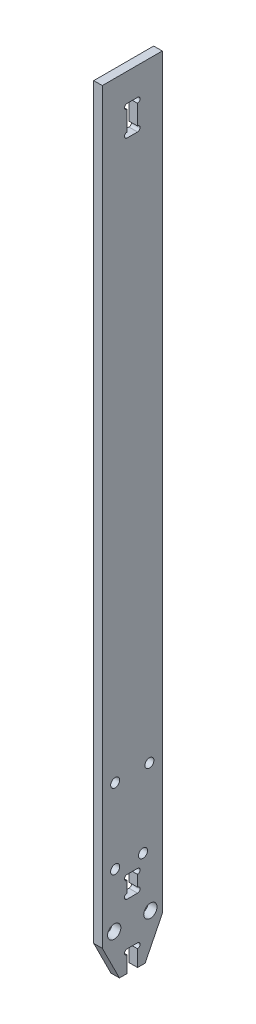
ISO-10303-21;
HEADER;
FILE_DESCRIPTION(('STEP AP214'),'2;1');
FILE_NAME('part.step','',(''),(''),'','','');
FILE_SCHEMA(('AUTOMOTIVE_DESIGN { 1 0 10303 214 1 1 1 1 }'));
ENDSEC;
DATA;
#1=APPLICATION_CONTEXT('core data for automotive mechanical design processes');
#2=APPLICATION_PROTOCOL_DEFINITION('international standard','automotive_design',2000,#1);
#3=PRODUCT_CONTEXT('',#1,'mechanical');
#4=PRODUCT('Part','Part','',(#3));
#5=PRODUCT_RELATED_PRODUCT_CATEGORY('part','',(#4));
#6=PRODUCT_DEFINITION_FORMATION('','',#4);
#7=PRODUCT_DEFINITION_CONTEXT('part definition',#1,'design');
#8=PRODUCT_DEFINITION('design','',#6,#7);
#9=PRODUCT_DEFINITION_SHAPE('','',#8);
#10=(LENGTH_UNIT() NAMED_UNIT(*) SI_UNIT(.MILLI.,.METRE.));
#11=(NAMED_UNIT(*) PLANE_ANGLE_UNIT() SI_UNIT($,.RADIAN.));
#12=(NAMED_UNIT(*) SI_UNIT($,.STERADIAN.) SOLID_ANGLE_UNIT());
#13=UNCERTAINTY_MEASURE_WITH_UNIT(LENGTH_MEASURE(1.E-05),#10,'distance_accuracy_value','');
#14=(GEOMETRIC_REPRESENTATION_CONTEXT(3) GLOBAL_UNCERTAINTY_ASSIGNED_CONTEXT((#13)) GLOBAL_UNIT_ASSIGNED_CONTEXT((#10,
#11,#12)) REPRESENTATION_CONTEXT('',''));
#15=CARTESIAN_POINT('',(0.,0.,0.));
#16=DIRECTION('',(0.,0.,1.));
#17=DIRECTION('',(1.,0.,0.));
#18=AXIS2_PLACEMENT_3D('',#15,#16,#17);
#19=CARTESIAN_POINT('',(1.,-91.25,-7.));
#20=DIRECTION('',(0.,1.,0.));
#21=DIRECTION('',(0.,0.,1.));
#22=AXIS2_PLACEMENT_3D('',#19,#20,#21);
#23=PLANE('',#22);
#24=DIRECTION('',(0.,0.,-1.));
#25=VECTOR('',#24,1.);
#26=CARTESIAN_POINT('',(1.,-91.25,-7.));
#27=LINE('',#26,#25);
#28=CARTESIAN_POINT('',(1.,-91.25,3.));
#29=VERTEX_POINT('',#28);
#30=CARTESIAN_POINT('',(1.,-91.25,1.22499999999995));
#31=VERTEX_POINT('',#30);
#32=EDGE_CURVE('E231',#29,#31,#27,.T.);
#33=ORIENTED_EDGE('',*,*,#32,.F.);
#34=DIRECTION('',(1.,0.,0.));
#35=VECTOR('',#34,1.);
#36=CARTESIAN_POINT('',(-1.,-91.25,3.));
#37=LINE('',#36,#35);
#38=CARTESIAN_POINT('',(-1.,-91.25,3.));
#39=VERTEX_POINT('',#38);
#40=EDGE_CURVE('E218',#39,#29,#37,.T.);
#41=ORIENTED_EDGE('',*,*,#40,.F.);
#42=DIRECTION('',(0.,0.,-1.));
#43=VECTOR('',#42,1.);
#44=CARTESIAN_POINT('',(-1.,-91.25,-7.));
#45=LINE('',#44,#43);
#46=CARTESIAN_POINT('',(-1.,-91.25,1.22499999999995));
#47=VERTEX_POINT('',#46);
#48=EDGE_CURVE('E229',#39,#47,#45,.T.);
#49=ORIENTED_EDGE('',*,*,#48,.T.);
#50=DIRECTION('',(1.,0.,0.));
#51=VECTOR('',#50,1.);
#52=CARTESIAN_POINT('',(-1.,-91.25,1.22499999999995));
#53=LINE('',#52,#51);
#54=EDGE_CURVE('E334',#47,#31,#53,.T.);
#55=ORIENTED_EDGE('',*,*,#54,.T.);
#56=EDGE_LOOP('',(#33,#41,#49,#55));
#57=FACE_BOUND('',#56,.T.);
#58=ADVANCED_FACE('F33',(#57),#23,.F.);
#59=CARTESIAN_POINT('',(1.,-91.25,7.));
#60=DIRECTION('',(0.,0.,-1.));
#61=DIRECTION('',(-1.,0.,0.));
#62=AXIS2_PLACEMENT_3D('',#59,#60,#61);
#63=PLANE('',#62);
#64=DIRECTION('',(0.,-1.,0.));
#65=VECTOR('',#64,1.);
#66=CARTESIAN_POINT('',(-1.,-91.25,7.));
#67=LINE('',#66,#65);
#68=CARTESIAN_POINT('',(-1.,91.25,7.));
#69=VERTEX_POINT('',#68);
#70=CARTESIAN_POINT('',(-1.,-83.2500000000001,6.99999999999998));
#71=VERTEX_POINT('',#70);
#72=EDGE_CURVE('E244',#69,#71,#67,.T.);
#73=ORIENTED_EDGE('',*,*,#72,.T.);
#74=DIRECTION('',(1.,0.,0.));
#75=VECTOR('',#74,1.);
#76=CARTESIAN_POINT('',(-1.,-83.25,7.));
#77=LINE('',#76,#75);
#78=CARTESIAN_POINT('',(1.,-83.25,7.));
#79=VERTEX_POINT('',#78);
#80=EDGE_CURVE('E56',#71,#79,#77,.T.);
#81=ORIENTED_EDGE('',*,*,#80,.T.);
#82=DIRECTION('',(0.,-1.,0.));
#83=VECTOR('',#82,1.);
#84=CARTESIAN_POINT('',(1.,-91.25,7.));
#85=LINE('',#84,#83);
#86=CARTESIAN_POINT('',(1.,91.25,7.));
#87=VERTEX_POINT('',#86);
#88=EDGE_CURVE('E249',#87,#79,#85,.T.);
#89=ORIENTED_EDGE('',*,*,#88,.F.);
#90=DIRECTION('',(-1.,0.,0.));
#91=VECTOR('',#90,1.);
#92=CARTESIAN_POINT('',(1.,91.25,7.));
#93=LINE('',#92,#91);
#94=EDGE_CURVE('E250',#87,#69,#93,.T.);
#95=ORIENTED_EDGE('',*,*,#94,.T.);
#96=EDGE_LOOP('',(#73,#81,#89,#95));
#97=FACE_BOUND('',#96,.T.);
#98=ADVANCED_FACE('F35',(#97),#63,.F.);
#99=CARTESIAN_POINT('',(-1.,-91.25,-1.22499999999995));
#100=VERTEX_POINT('',#99);
#101=CARTESIAN_POINT('',(-1.,-91.25,-3.));
#102=VERTEX_POINT('',#101);
#103=EDGE_CURVE('E239',#100,#102,#45,.T.);
#104=ORIENTED_EDGE('',*,*,#103,.T.);
#105=DIRECTION('',(1.,0.,0.));
#106=VECTOR('',#105,1.);
#107=CARTESIAN_POINT('',(-1.,-91.2499999999999,-3.));
#108=LINE('',#107,#106);
#109=CARTESIAN_POINT('',(1.,-91.2499999999999,-3.));
#110=VERTEX_POINT('',#109);
#111=EDGE_CURVE('E48',#102,#110,#108,.T.);
#112=ORIENTED_EDGE('',*,*,#111,.T.);
#113=CARTESIAN_POINT('',(1.,-91.25,-1.22499999999995));
#114=VERTEX_POINT('',#113);
#115=EDGE_CURVE('E352',#114,#110,#27,.T.);
#116=ORIENTED_EDGE('',*,*,#115,.F.);
#117=DIRECTION('',(1.,0.,0.));
#118=VECTOR('',#117,1.);
#119=CARTESIAN_POINT('',(-1.,-91.25,-1.22499999999995));
#120=LINE('',#119,#118);
#121=EDGE_CURVE('E347',#100,#114,#120,.T.);
#122=ORIENTED_EDGE('',*,*,#121,.F.);
#123=EDGE_LOOP('',(#104,#112,#116,#122));
#124=FACE_BOUND('',#123,.T.);
#125=ADVANCED_FACE('F507',(#124),#23,.F.);
#126=CARTESIAN_POINT('',(1.,-91.25,-7.));
#127=DIRECTION('',(0.,0.,1.));
#128=DIRECTION('',(1.,0.,0.));
#129=AXIS2_PLACEMENT_3D('',#126,#127,#128);
#130=PLANE('',#129);
#131=DIRECTION('',(0.,1.,0.));
#132=VECTOR('',#131,1.);
#133=CARTESIAN_POINT('',(1.,-91.25,-7.));
#134=LINE('',#133,#132);
#135=CARTESIAN_POINT('',(1.,-83.2499999999999,-6.99999999999984));
#136=VERTEX_POINT('',#135);
#137=CARTESIAN_POINT('',(1.,91.25,-7.));
#138=VERTEX_POINT('',#137);
#139=EDGE_CURVE('E354',#136,#138,#134,.T.);
#140=ORIENTED_EDGE('',*,*,#139,.F.);
#141=DIRECTION('',(1.,0.,0.));
#142=VECTOR('',#141,1.);
#143=CARTESIAN_POINT('',(-1.,-83.2499999999999,-6.99999999999984));
#144=LINE('',#143,#142);
#145=CARTESIAN_POINT('',(-1.,-83.2499999999999,-6.99999999999984));
#146=VERTEX_POINT('',#145);
#147=EDGE_CURVE('E379',#146,#136,#144,.T.);
#148=ORIENTED_EDGE('',*,*,#147,.F.);
#149=DIRECTION('',(0.,1.,0.));
#150=VECTOR('',#149,1.);
#151=CARTESIAN_POINT('',(-1.,-91.25,-7.));
#152=LINE('',#151,#150);
#153=CARTESIAN_POINT('',(-1.,91.25,-7.));
#154=VERTEX_POINT('',#153);
#155=EDGE_CURVE('E238',#146,#154,#152,.T.);
#156=ORIENTED_EDGE('',*,*,#155,.T.);
#157=DIRECTION('',(-1.,0.,0.));
#158=VECTOR('',#157,1.);
#159=CARTESIAN_POINT('',(1.,91.25,-7.));
#160=LINE('',#159,#158);
#161=EDGE_CURVE('E253',#138,#154,#160,.T.);
#162=ORIENTED_EDGE('',*,*,#161,.F.);
#163=EDGE_LOOP('',(#140,#148,#156,#162));
#164=FACE_BOUND('',#163,.T.);
#165=ADVANCED_FACE('F513',(#164),#130,.F.);
#166=CARTESIAN_POINT('',(1.,91.25,-7.));
#167=DIRECTION('',(0.,-1.,0.));
#168=DIRECTION('',(0.,0.,-1.));
#169=AXIS2_PLACEMENT_3D('',#166,#167,#168);
#170=PLANE('',#169);
#171=DIRECTION('',(0.,0.,1.));
#172=VECTOR('',#171,1.);
#173=CARTESIAN_POINT('',(-1.,91.25,-7.));
#174=LINE('',#173,#172);
#175=EDGE_CURVE('E241',#154,#69,#174,.T.);
#176=ORIENTED_EDGE('',*,*,#175,.T.);
#177=ORIENTED_EDGE('',*,*,#94,.F.);
#178=DIRECTION('',(0.,0.,1.));
#179=VECTOR('',#178,1.);
#180=CARTESIAN_POINT('',(1.,91.25,-7.));
#181=LINE('',#180,#179);
#182=EDGE_CURVE('E254',#138,#87,#181,.T.);
#183=ORIENTED_EDGE('',*,*,#182,.F.);
#184=ORIENTED_EDGE('',*,*,#161,.T.);
#185=EDGE_LOOP('',(#176,#177,#183,#184));
#186=FACE_BOUND('',#185,.T.);
#187=ADVANCED_FACE('F365',(#186),#170,.F.);
#188=CARTESIAN_POINT('',(1.,0.,0.));
#189=DIRECTION('',(1.,0.,0.));
#190=DIRECTION('',(0.,0.,-1.));
#191=AXIS2_PLACEMENT_3D('',#188,#189,#190);
#192=PLANE('',#191);
#193=CARTESIAN_POINT('',(1.,-51.25,-4.));
#194=DIRECTION('',(-1.,0.,0.));
#195=DIRECTION('',(0.,0.,1.));
#196=AXIS2_PLACEMENT_3D('',#193,#194,#195);
#197=CIRCLE('',#196,1.04999999999999);
#198=CARTESIAN_POINT('',(1.,-51.25,-2.95000000000001));
#199=VERTEX_POINT('',#198);
#200=EDGE_CURVE('E881',#199,#199,#197,.T.);
#201=ORIENTED_EDGE('',*,*,#200,.T.);
#202=EDGE_LOOP('',(#201));
#203=FACE_BOUND('',#202,.T.);
#204=CARTESIAN_POINT('',(1.,-51.25,4.));
#205=DIRECTION('',(-1.,0.,0.));
#206=DIRECTION('',(0.,0.,1.));
#207=AXIS2_PLACEMENT_3D('',#204,#205,#206);
#208=CIRCLE('',#207,1.04999999999999);
#209=CARTESIAN_POINT('',(1.,-51.25,5.04999999999999));
#210=VERTEX_POINT('',#209);
#211=EDGE_CURVE('E886',#210,#210,#208,.T.);
#212=ORIENTED_EDGE('',*,*,#211,.T.);
#213=EDGE_LOOP('',(#212));
#214=FACE_BOUND('',#213,.T.);
#215=CARTESIAN_POINT('',(1.,-68.75,-2.49999999999984));
#216=DIRECTION('',(-1.,0.,0.));
#217=DIRECTION('',(0.,0.,1.));
#218=AXIS2_PLACEMENT_3D('',#215,#216,#217);
#219=CIRCLE('',#218,1.04999999999999);
#220=CARTESIAN_POINT('',(1.,-68.75,-1.44999999999984));
#221=VERTEX_POINT('',#220);
#222=EDGE_CURVE('E873',#221,#221,#219,.T.);
#223=ORIENTED_EDGE('',*,*,#222,.T.);
#224=EDGE_LOOP('',(#223));
#225=FACE_BOUND('',#224,.T.);
#226=CARTESIAN_POINT('',(1.,-68.75,4.));
#227=DIRECTION('',(1.,0.,0.));
#228=DIRECTION('',(0.,0.,-1.));
#229=AXIS2_PLACEMENT_3D('',#226,#227,#228);
#230=CIRCLE('',#229,1.04999999999999);
#231=CARTESIAN_POINT('',(1.,-68.75,2.95000000000001));
#232=VERTEX_POINT('',#231);
#233=EDGE_CURVE('E871',#232,#232,#230,.T.);
#234=ORIENTED_EDGE('',*,*,#233,.F.);
#235=EDGE_LOOP('',(#234));
#236=FACE_BOUND('',#235,.T.);
#237=DIRECTION('',(0.,0.894427190999916,0.447213595499958));
#238=VECTOR('',#237,1.);
#239=CARTESIAN_POINT('',(1.,-91.25,3.));
#240=LINE('',#239,#238);
#241=EDGE_CURVE('E224',#29,#79,#240,.T.);
#242=ORIENTED_EDGE('',*,*,#241,.F.);
#243=ORIENTED_EDGE('',*,*,#32,.T.);
#244=DIRECTION('',(0.,-1.,0.));
#245=VECTOR('',#244,1.);
#246=CARTESIAN_POINT('',(1.,-91.25,1.22499999999995));
#247=LINE('',#246,#245);
#248=CARTESIAN_POINT('',(1.,-87.45,1.22500000000003));
#249=VERTEX_POINT('',#248);
#250=EDGE_CURVE('E325',#249,#31,#247,.T.);
#251=ORIENTED_EDGE('',*,*,#250,.F.);
#252=CARTESIAN_POINT('',(1.,-86.85,1.22500000000005));
#253=DIRECTION('',(1.,0.,0.));
#254=DIRECTION('',(0.,0.,-1.));
#255=AXIS2_PLACEMENT_3D('',#252,#253,#254);
#256=CIRCLE('',#255,0.600000000000003);
#257=CARTESIAN_POINT('',(1.,-86.25,1.22500000000005));
#258=VERTEX_POINT('',#257);
#259=EDGE_CURVE('E317',#258,#249,#256,.T.);
#260=ORIENTED_EDGE('',*,*,#259,.F.);
#261=DIRECTION('',(0.,0.,1.));
#262=VECTOR('',#261,1.);
#263=CARTESIAN_POINT('',(1.,-86.25,1.22500000000005));
#264=LINE('',#263,#262);
#265=CARTESIAN_POINT('',(1.,-86.25,-1.22499999999995));
#266=VERTEX_POINT('',#265);
#267=EDGE_CURVE('E328',#266,#258,#264,.T.);
#268=ORIENTED_EDGE('',*,*,#267,.F.);
#269=CARTESIAN_POINT('',(1.,-86.85,-1.22499999999995));
#270=DIRECTION('',(1.,0.,0.));
#271=DIRECTION('',(0.,0.,-1.));
#272=AXIS2_PLACEMENT_3D('',#269,#270,#271);
#273=CIRCLE('',#272,0.600000000000003);
#274=CARTESIAN_POINT('',(1.,-87.45,-1.22499999999995));
#275=VERTEX_POINT('',#274);
#276=EDGE_CURVE('E309',#275,#266,#273,.T.);
#277=ORIENTED_EDGE('',*,*,#276,.F.);
#278=DIRECTION('',(0.,1.,0.));
#279=VECTOR('',#278,1.);
#280=CARTESIAN_POINT('',(1.,-91.25,-1.22499999999995));
#281=LINE('',#280,#279);
#282=EDGE_CURVE('E337',#114,#275,#281,.T.);
#283=ORIENTED_EDGE('',*,*,#282,.F.);
#284=ORIENTED_EDGE('',*,*,#115,.T.);
#285=DIRECTION('',(0.,-0.894427190999925,0.44721359549994));
#286=VECTOR('',#285,1.);
#287=CARTESIAN_POINT('',(1.,-91.2499999999999,-3.));
#288=LINE('',#287,#286);
#289=EDGE_CURVE('E376',#136,#110,#288,.T.);
#290=ORIENTED_EDGE('',*,*,#289,.F.);
#291=ORIENTED_EDGE('',*,*,#139,.T.);
#292=ORIENTED_EDGE('',*,*,#182,.T.);
#293=ORIENTED_EDGE('',*,*,#88,.T.);
#294=EDGE_LOOP('',(#242,#243,#251,#260,#268,#277,#283,#284,#290,#291,#292,#293));
#295=FACE_BOUND('',#294,.T.);
#296=CARTESIAN_POINT('',(1.,78.35,1.225));
#297=DIRECTION('',(1.,0.,0.));
#298=DIRECTION('',(0.,0.,-1.));
#299=AXIS2_PLACEMENT_3D('',#296,#297,#298);
#300=CIRCLE('',#299,0.600000000000001);
#301=CARTESIAN_POINT('',(1.,78.95,1.225));
#302=VERTEX_POINT('',#301);
#303=CARTESIAN_POINT('',(1.,77.75,1.225));
#304=VERTEX_POINT('',#303);
#305=EDGE_CURVE('E389',#302,#304,#300,.T.);
#306=ORIENTED_EDGE('',*,*,#305,.F.);
#307=DIRECTION('',(0.,-1.,0.));
#308=VECTOR('',#307,1.);
#309=CARTESIAN_POINT('',(1.,77.75,1.225));
#310=LINE('',#309,#308);
#311=CARTESIAN_POINT('',(1.,83.55,1.225));
#312=VERTEX_POINT('',#311);
#313=EDGE_CURVE('E408',#312,#302,#310,.T.);
#314=ORIENTED_EDGE('',*,*,#313,.F.);
#315=CARTESIAN_POINT('',(1.,84.15,1.225));
#316=DIRECTION('',(1.,0.,0.));
#317=DIRECTION('',(0.,0.,-1.));
#318=AXIS2_PLACEMENT_3D('',#315,#316,#317);
#319=CIRCLE('',#318,0.600000000000001);
#320=CARTESIAN_POINT('',(1.,84.75,1.225));
#321=VERTEX_POINT('',#320);
#322=EDGE_CURVE('E388',#321,#312,#319,.T.);
#323=ORIENTED_EDGE('',*,*,#322,.F.);
#324=DIRECTION('',(0.,0.,1.));
#325=VECTOR('',#324,1.);
#326=CARTESIAN_POINT('',(1.,84.75,-1.225));
#327=LINE('',#326,#325);
#328=CARTESIAN_POINT('',(1.,84.75,-1.225));
#329=VERTEX_POINT('',#328);
#330=EDGE_CURVE('E413',#329,#321,#327,.T.);
#331=ORIENTED_EDGE('',*,*,#330,.F.);
#332=CARTESIAN_POINT('',(1.,84.15,-1.225));
#333=DIRECTION('',(1.,0.,0.));
#334=DIRECTION('',(0.,0.,-1.));
#335=AXIS2_PLACEMENT_3D('',#332,#333,#334);
#336=CIRCLE('',#335,0.600000000000001);
#337=CARTESIAN_POINT('',(1.,83.55,-1.225));
#338=VERTEX_POINT('',#337);
#339=EDGE_CURVE('E383',#338,#329,#336,.T.);
#340=ORIENTED_EDGE('',*,*,#339,.F.);
#341=DIRECTION('',(0.,1.,0.));
#342=VECTOR('',#341,1.);
#343=CARTESIAN_POINT('',(1.,77.75,-1.225));
#344=LINE('',#343,#342);
#345=CARTESIAN_POINT('',(1.,78.95,-1.225));
#346=VERTEX_POINT('',#345);
#347=EDGE_CURVE('E428',#346,#338,#344,.T.);
#348=ORIENTED_EDGE('',*,*,#347,.F.);
#349=CARTESIAN_POINT('',(1.,78.35,-1.225));
#350=DIRECTION('',(1.,0.,0.));
#351=DIRECTION('',(0.,0.,-1.));
#352=AXIS2_PLACEMENT_3D('',#349,#350,#351);
#353=CIRCLE('',#352,0.600000000000001);
#354=CARTESIAN_POINT('',(1.,77.75,-1.225));
#355=VERTEX_POINT('',#354);
#356=EDGE_CURVE('E368',#355,#346,#353,.T.);
#357=ORIENTED_EDGE('',*,*,#356,.F.);
#358=DIRECTION('',(0.,0.,-1.));
#359=VECTOR('',#358,1.);
#360=CARTESIAN_POINT('',(1.,77.75,-1.225));
#361=LINE('',#360,#359);
#362=EDGE_CURVE('E425',#304,#355,#361,.T.);
#363=ORIENTED_EDGE('',*,*,#362,.F.);
#364=EDGE_LOOP('',(#306,#314,#323,#331,#340,#348,#357,#363));
#365=FACE_BOUND('',#364,.T.);
#366=CARTESIAN_POINT('',(1.,-81.25,4.22500000000003));
#367=DIRECTION('',(1.,0.,0.));
#368=DIRECTION('',(0.,0.,-1.));
#369=AXIS2_PLACEMENT_3D('',#366,#367,#368);
#370=CIRCLE('',#369,1.55);
#371=CARTESIAN_POINT('',(1.,-81.25,2.67500000000003));
#372=VERTEX_POINT('',#371);
#373=EDGE_CURVE('E447',#372,#372,#370,.T.);
#374=ORIENTED_EDGE('',*,*,#373,.F.);
#375=EDGE_LOOP('',(#374));
#376=FACE_BOUND('',#375,.T.);
#377=CARTESIAN_POINT('',(1.,-81.25,-4.22500000000003));
#378=DIRECTION('',(1.,0.,0.));
#379=DIRECTION('',(0.,0.,1.));
#380=AXIS2_PLACEMENT_3D('',#377,#378,#379);
#381=CIRCLE('',#380,1.55);
#382=CARTESIAN_POINT('',(1.,-81.25,-2.67500000000003));
#383=VERTEX_POINT('',#382);
#384=EDGE_CURVE('E435',#383,#383,#381,.T.);
#385=ORIENTED_EDGE('',*,*,#384,.F.);
#386=EDGE_LOOP('',(#385));
#387=FACE_BOUND('',#386,.T.);
#388=CARTESIAN_POINT('',(1.,-75.6,1.22500000000003));
#389=DIRECTION('',(1.,0.,0.));
#390=DIRECTION('',(0.,0.,-1.));
#391=AXIS2_PLACEMENT_3D('',#388,#389,#390);
#392=CIRCLE('',#391,0.600000000000005);
#393=CARTESIAN_POINT('',(1.,-75.,1.22500000000003));
#394=VERTEX_POINT('',#393);
#395=CARTESIAN_POINT('',(1.,-76.2,1.22500000000003));
#396=VERTEX_POINT('',#395);
#397=EDGE_CURVE('E462',#394,#396,#392,.T.);
#398=ORIENTED_EDGE('',*,*,#397,.F.);
#399=DIRECTION('',(0.,-1.,0.));
#400=VECTOR('',#399,1.);
#401=CARTESIAN_POINT('',(1.,-76.2,1.22500000000003));
#402=LINE('',#401,#400);
#403=CARTESIAN_POINT('',(1.,-72.4,1.22500000000003));
#404=VERTEX_POINT('',#403);
#405=EDGE_CURVE('E274',#404,#394,#402,.T.);
#406=ORIENTED_EDGE('',*,*,#405,.F.);
#407=CARTESIAN_POINT('',(1.,-71.8,1.22500000000003));
#408=DIRECTION('',(1.,0.,0.));
#409=DIRECTION('',(0.,0.,-1.));
#410=AXIS2_PLACEMENT_3D('',#407,#408,#409);
#411=CIRCLE('',#410,0.600000000000005);
#412=CARTESIAN_POINT('',(1.,-71.2,1.22500000000003));
#413=VERTEX_POINT('',#412);
#414=EDGE_CURVE('E461',#413,#404,#411,.T.);
#415=ORIENTED_EDGE('',*,*,#414,.F.);
#416=DIRECTION('',(0.,0.,1.));
#417=VECTOR('',#416,1.);
#418=CARTESIAN_POINT('',(1.,-71.2,1.22500000000003));
#419=LINE('',#418,#417);
#420=CARTESIAN_POINT('',(1.,-71.2,-1.22499999999995));
#421=VERTEX_POINT('',#420);
#422=EDGE_CURVE('E301',#421,#413,#419,.T.);
#423=ORIENTED_EDGE('',*,*,#422,.F.);
#424=CARTESIAN_POINT('',(1.,-71.8,-1.22499999999995));
#425=DIRECTION('',(1.,0.,0.));
#426=DIRECTION('',(0.,0.,-1.));
#427=AXIS2_PLACEMENT_3D('',#424,#425,#426);
#428=CIRCLE('',#427,0.600000000000005);
#429=CARTESIAN_POINT('',(1.,-72.4,-1.22499999999995));
#430=VERTEX_POINT('',#429);
#431=EDGE_CURVE('E458',#430,#421,#428,.T.);
#432=ORIENTED_EDGE('',*,*,#431,.F.);
#433=DIRECTION('',(0.,1.,0.));
#434=VECTOR('',#433,1.);
#435=CARTESIAN_POINT('',(1.,-71.2,-1.22499999999995));
#436=LINE('',#435,#434);
#437=CARTESIAN_POINT('',(1.,-75.,-1.22499999999995));
#438=VERTEX_POINT('',#437);
#439=EDGE_CURVE('E297',#438,#430,#436,.T.);
#440=ORIENTED_EDGE('',*,*,#439,.F.);
#441=CARTESIAN_POINT('',(1.,-75.6,-1.22499999999995));
#442=DIRECTION('',(1.,0.,0.));
#443=DIRECTION('',(0.,0.,-1.));
#444=AXIS2_PLACEMENT_3D('',#441,#442,#443);
#445=CIRCLE('',#444,0.600000000000005);
#446=CARTESIAN_POINT('',(1.,-76.2,-1.22499999999995));
#447=VERTEX_POINT('',#446);
#448=EDGE_CURVE('E446',#447,#438,#445,.T.);
#449=ORIENTED_EDGE('',*,*,#448,.F.);
#450=DIRECTION('',(0.,0.,-1.));
#451=VECTOR('',#450,1.);
#452=CARTESIAN_POINT('',(1.,-76.2,-1.22499999999995));
#453=LINE('',#452,#451);
#454=EDGE_CURVE('E294',#396,#447,#453,.T.);
#455=ORIENTED_EDGE('',*,*,#454,.F.);
#456=EDGE_LOOP('',(#398,#406,#415,#423,#432,#440,#449,#455));
#457=FACE_BOUND('',#456,.T.);
#458=ADVANCED_FACE('F358',(#203,#214,#225,#236,#295,#365,#376,#387,#457),#192,.T.);
#459=CARTESIAN_POINT('',(-1.,0.,0.));
#460=DIRECTION('',(1.,0.,0.));
#461=DIRECTION('',(0.,0.,-1.));
#462=AXIS2_PLACEMENT_3D('',#459,#460,#461);
#463=PLANE('',#462);
#464=CARTESIAN_POINT('',(-1.,-51.25,-4.));
#465=DIRECTION('',(-1.,0.,0.));
#466=DIRECTION('',(0.,0.,1.));
#467=AXIS2_PLACEMENT_3D('',#464,#465,#466);
#468=CIRCLE('',#467,1.04999999999999);
#469=CARTESIAN_POINT('',(-1.,-51.25,-2.95000000000001));
#470=VERTEX_POINT('',#469);
#471=EDGE_CURVE('E889',#470,#470,#468,.T.);
#472=ORIENTED_EDGE('',*,*,#471,.F.);
#473=EDGE_LOOP('',(#472));
#474=FACE_BOUND('',#473,.T.);
#475=CARTESIAN_POINT('',(-1.,-51.25,4.));
#476=DIRECTION('',(-1.,0.,0.));
#477=DIRECTION('',(0.,0.,1.));
#478=AXIS2_PLACEMENT_3D('',#475,#476,#477);
#479=CIRCLE('',#478,1.04999999999999);
#480=CARTESIAN_POINT('',(-1.,-51.25,5.04999999999999));
#481=VERTEX_POINT('',#480);
#482=EDGE_CURVE('E883',#481,#481,#479,.T.);
#483=ORIENTED_EDGE('',*,*,#482,.F.);
#484=EDGE_LOOP('',(#483));
#485=FACE_BOUND('',#484,.T.);
#486=CARTESIAN_POINT('',(-1.,-68.75,-2.49999999999984));
#487=DIRECTION('',(-1.,0.,0.));
#488=DIRECTION('',(0.,0.,1.));
#489=AXIS2_PLACEMENT_3D('',#486,#487,#488);
#490=CIRCLE('',#489,1.04999999999999);
#491=CARTESIAN_POINT('',(-1.,-68.75,-1.44999999999984));
#492=VERTEX_POINT('',#491);
#493=EDGE_CURVE('E877',#492,#492,#490,.T.);
#494=ORIENTED_EDGE('',*,*,#493,.F.);
#495=EDGE_LOOP('',(#494));
#496=FACE_BOUND('',#495,.T.);
#497=CARTESIAN_POINT('',(-1.,-68.75,4.));
#498=DIRECTION('',(1.,0.,0.));
#499=DIRECTION('',(0.,0.,-1.));
#500=AXIS2_PLACEMENT_3D('',#497,#498,#499);
#501=CIRCLE('',#500,1.04999999999999);
#502=CARTESIAN_POINT('',(-1.,-68.75,2.95000000000001));
#503=VERTEX_POINT('',#502);
#504=EDGE_CURVE('E378',#503,#503,#501,.T.);
#505=ORIENTED_EDGE('',*,*,#504,.T.);
#506=EDGE_LOOP('',(#505));
#507=FACE_BOUND('',#506,.T.);
#508=DIRECTION('',(0.,-1.,0.));
#509=VECTOR('',#508,1.);
#510=CARTESIAN_POINT('',(-1.,77.75,1.225));
#511=LINE('',#510,#509);
#512=CARTESIAN_POINT('',(-1.,83.55,1.225));
#513=VERTEX_POINT('',#512);
#514=CARTESIAN_POINT('',(-1.,78.95,1.225));
#515=VERTEX_POINT('',#514);
#516=EDGE_CURVE('E409',#513,#515,#511,.T.);
#517=ORIENTED_EDGE('',*,*,#516,.T.);
#518=CARTESIAN_POINT('',(-1.,78.35,1.225));
#519=DIRECTION('',(1.,0.,0.));
#520=DIRECTION('',(0.,0.,-1.));
#521=AXIS2_PLACEMENT_3D('',#518,#519,#520);
#522=CIRCLE('',#521,0.600000000000001);
#523=CARTESIAN_POINT('',(-1.,77.75,1.225));
#524=VERTEX_POINT('',#523);
#525=EDGE_CURVE('E385',#515,#524,#522,.T.);
#526=ORIENTED_EDGE('',*,*,#525,.T.);
#527=DIRECTION('',(0.,0.,-1.));
#528=VECTOR('',#527,1.);
#529=CARTESIAN_POINT('',(-1.,77.75,-1.225));
#530=LINE('',#529,#528);
#531=CARTESIAN_POINT('',(-1.,77.75,-1.225));
#532=VERTEX_POINT('',#531);
#533=EDGE_CURVE('E412',#524,#532,#530,.T.);
#534=ORIENTED_EDGE('',*,*,#533,.T.);
#535=CARTESIAN_POINT('',(-1.,78.35,-1.225));
#536=DIRECTION('',(1.,0.,0.));
#537=DIRECTION('',(0.,0.,-1.));
#538=AXIS2_PLACEMENT_3D('',#535,#536,#537);
#539=CIRCLE('',#538,0.600000000000001);
#540=CARTESIAN_POINT('',(-1.,78.95,-1.225));
#541=VERTEX_POINT('',#540);
#542=EDGE_CURVE('E370',#532,#541,#539,.T.);
#543=ORIENTED_EDGE('',*,*,#542,.T.);
#544=DIRECTION('',(0.,1.,0.));
#545=VECTOR('',#544,1.);
#546=CARTESIAN_POINT('',(-1.,77.75,-1.225));
#547=LINE('',#546,#545);
#548=CARTESIAN_POINT('',(-1.,83.55,-1.225));
#549=VERTEX_POINT('',#548);
#550=EDGE_CURVE('E416',#541,#549,#547,.T.);
#551=ORIENTED_EDGE('',*,*,#550,.T.);
#552=CARTESIAN_POINT('',(-1.,84.15,-1.225));
#553=DIRECTION('',(1.,0.,0.));
#554=DIRECTION('',(0.,0.,-1.));
#555=AXIS2_PLACEMENT_3D('',#552,#553,#554);
#556=CIRCLE('',#555,0.600000000000001);
#557=CARTESIAN_POINT('',(-1.,84.75,-1.225));
#558=VERTEX_POINT('',#557);
#559=EDGE_CURVE('E391',#549,#558,#556,.T.);
#560=ORIENTED_EDGE('',*,*,#559,.T.);
#561=DIRECTION('',(0.,0.,1.));
#562=VECTOR('',#561,1.);
#563=CARTESIAN_POINT('',(-1.,84.75,-1.225));
#564=LINE('',#563,#562);
#565=CARTESIAN_POINT('',(-1.,84.75,1.225));
#566=VERTEX_POINT('',#565);
#567=EDGE_CURVE('E419',#558,#566,#564,.T.);
#568=ORIENTED_EDGE('',*,*,#567,.T.);
#569=CARTESIAN_POINT('',(-1.,84.15,1.225));
#570=DIRECTION('',(1.,0.,0.));
#571=DIRECTION('',(0.,0.,-1.));
#572=AXIS2_PLACEMENT_3D('',#569,#570,#571);
#573=CIRCLE('',#572,0.600000000000001);
#574=EDGE_CURVE('E395',#566,#513,#573,.T.);
#575=ORIENTED_EDGE('',*,*,#574,.T.);
#576=EDGE_LOOP('',(#517,#526,#534,#543,#551,#560,#568,#575));
#577=FACE_BOUND('',#576,.T.);
#578=CARTESIAN_POINT('',(-1.,-81.25,4.22500000000003));
#579=DIRECTION('',(1.,0.,0.));
#580=DIRECTION('',(0.,0.,-1.));
#581=AXIS2_PLACEMENT_3D('',#578,#579,#580);
#582=CIRCLE('',#581,1.55);
#583=CARTESIAN_POINT('',(-1.,-81.25,2.67500000000003));
#584=VERTEX_POINT('',#583);
#585=EDGE_CURVE('E443',#584,#584,#582,.T.);
#586=ORIENTED_EDGE('',*,*,#585,.T.);
#587=EDGE_LOOP('',(#586));
#588=FACE_BOUND('',#587,.T.);
#589=CARTESIAN_POINT('',(-1.,-81.25,-4.22500000000003));
#590=DIRECTION('',(1.,0.,0.));
#591=DIRECTION('',(0.,0.,1.));
#592=AXIS2_PLACEMENT_3D('',#589,#590,#591);
#593=CIRCLE('',#592,1.55);
#594=CARTESIAN_POINT('',(-1.,-81.25,-2.67500000000003));
#595=VERTEX_POINT('',#594);
#596=EDGE_CURVE('E450',#595,#595,#593,.T.);
#597=ORIENTED_EDGE('',*,*,#596,.T.);
#598=EDGE_LOOP('',(#597));
#599=FACE_BOUND('',#598,.T.);
#600=DIRECTION('',(0.,-1.,0.));
#601=VECTOR('',#600,1.);
#602=CARTESIAN_POINT('',(-1.,-76.2,1.22500000000003));
#603=LINE('',#602,#601);
#604=CARTESIAN_POINT('',(-1.,-72.4,1.22500000000003));
#605=VERTEX_POINT('',#604);
#606=CARTESIAN_POINT('',(-1.,-75.,1.22500000000003));
#607=VERTEX_POINT('',#606);
#608=EDGE_CURVE('E272',#605,#607,#603,.T.);
#609=ORIENTED_EDGE('',*,*,#608,.T.);
#610=CARTESIAN_POINT('',(-1.,-75.6,1.22500000000003));
#611=DIRECTION('',(1.,0.,0.));
#612=DIRECTION('',(0.,0.,-1.));
#613=AXIS2_PLACEMENT_3D('',#610,#611,#612);
#614=CIRCLE('',#613,0.600000000000005);
#615=CARTESIAN_POINT('',(-1.,-76.2,1.22500000000003));
#616=VERTEX_POINT('',#615);
#617=EDGE_CURVE('E281',#607,#616,#614,.T.);
#618=ORIENTED_EDGE('',*,*,#617,.T.);
#619=DIRECTION('',(0.,0.,-1.));
#620=VECTOR('',#619,1.);
#621=CARTESIAN_POINT('',(-1.,-76.2,-1.22499999999995));
#622=LINE('',#621,#620);
#623=CARTESIAN_POINT('',(-1.,-76.2,-1.22499999999995));
#624=VERTEX_POINT('',#623);
#625=EDGE_CURVE('E305',#616,#624,#622,.T.);
#626=ORIENTED_EDGE('',*,*,#625,.T.);
#627=CARTESIAN_POINT('',(-1.,-75.6,-1.22499999999995));
#628=DIRECTION('',(1.,0.,0.));
#629=DIRECTION('',(0.,0.,-1.));
#630=AXIS2_PLACEMENT_3D('',#627,#628,#629);
#631=CIRCLE('',#630,0.600000000000005);
#632=CARTESIAN_POINT('',(-1.,-75.,-1.22499999999995));
#633=VERTEX_POINT('',#632);
#634=EDGE_CURVE('E455',#624,#633,#631,.T.);
#635=ORIENTED_EDGE('',*,*,#634,.T.);
#636=DIRECTION('',(0.,1.,0.));
#637=VECTOR('',#636,1.);
#638=CARTESIAN_POINT('',(-1.,-71.2,-1.22499999999995));
#639=LINE('',#638,#637);
#640=CARTESIAN_POINT('',(-1.,-72.4,-1.22499999999995));
#641=VERTEX_POINT('',#640);
#642=EDGE_CURVE('E290',#633,#641,#639,.T.);
#643=ORIENTED_EDGE('',*,*,#642,.T.);
#644=CARTESIAN_POINT('',(-1.,-71.8,-1.22499999999995));
#645=DIRECTION('',(1.,0.,0.));
#646=DIRECTION('',(0.,0.,-1.));
#647=AXIS2_PLACEMENT_3D('',#644,#645,#646);
#648=CIRCLE('',#647,0.600000000000005);
#649=CARTESIAN_POINT('',(-1.,-71.2,-1.22499999999995));
#650=VERTEX_POINT('',#649);
#651=EDGE_CURVE('E464',#641,#650,#648,.T.);
#652=ORIENTED_EDGE('',*,*,#651,.T.);
#653=DIRECTION('',(0.,0.,1.));
#654=VECTOR('',#653,1.);
#655=CARTESIAN_POINT('',(-1.,-71.2,1.22500000000003));
#656=LINE('',#655,#654);
#657=CARTESIAN_POINT('',(-1.,-71.2,1.22500000000003));
#658=VERTEX_POINT('',#657);
#659=EDGE_CURVE('E286',#650,#658,#656,.T.);
#660=ORIENTED_EDGE('',*,*,#659,.T.);
#661=CARTESIAN_POINT('',(-1.,-71.8,1.22500000000003));
#662=DIRECTION('',(1.,0.,0.));
#663=DIRECTION('',(0.,0.,-1.));
#664=AXIS2_PLACEMENT_3D('',#661,#662,#663);
#665=CIRCLE('',#664,0.600000000000005);
#666=EDGE_CURVE('E284',#658,#605,#665,.T.);
#667=ORIENTED_EDGE('',*,*,#666,.T.);
#668=EDGE_LOOP('',(#609,#618,#626,#635,#643,#652,#660,#667));
#669=FACE_BOUND('',#668,.T.);
#670=ORIENTED_EDGE('',*,*,#48,.F.);
#671=DIRECTION('',(0.,0.894427190999916,0.447213595499958));
#672=VECTOR('',#671,1.);
#673=CARTESIAN_POINT('',(-1.,-91.25,3.));
#674=LINE('',#673,#672);
#675=EDGE_CURVE('E215',#39,#71,#674,.T.);
#676=ORIENTED_EDGE('',*,*,#675,.T.);
#677=ORIENTED_EDGE('',*,*,#72,.F.);
#678=ORIENTED_EDGE('',*,*,#175,.F.);
#679=ORIENTED_EDGE('',*,*,#155,.F.);
#680=DIRECTION('',(0.,-0.894427190999925,0.44721359549994));
#681=VECTOR('',#680,1.);
#682=CARTESIAN_POINT('',(-1.,-91.2499999999999,-3.));
#683=LINE('',#682,#681);
#684=EDGE_CURVE('E374',#146,#102,#683,.T.);
#685=ORIENTED_EDGE('',*,*,#684,.T.);
#686=ORIENTED_EDGE('',*,*,#103,.F.);
#687=DIRECTION('',(0.,1.,0.));
#688=VECTOR('',#687,1.);
#689=CARTESIAN_POINT('',(-1.,-91.25,-1.22499999999995));
#690=LINE('',#689,#688);
#691=CARTESIAN_POINT('',(-1.,-87.45,-1.22499999999995));
#692=VERTEX_POINT('',#691);
#693=EDGE_CURVE('E327',#100,#692,#690,.T.);
#694=ORIENTED_EDGE('',*,*,#693,.T.);
#695=CARTESIAN_POINT('',(-1.,-86.85,-1.22499999999995));
#696=DIRECTION('',(1.,0.,0.));
#697=DIRECTION('',(0.,0.,-1.));
#698=AXIS2_PLACEMENT_3D('',#695,#696,#697);
#699=CIRCLE('',#698,0.600000000000003);
#700=CARTESIAN_POINT('',(-1.,-86.25,-1.22499999999995));
#701=VERTEX_POINT('',#700);
#702=EDGE_CURVE('E319',#692,#701,#699,.T.);
#703=ORIENTED_EDGE('',*,*,#702,.T.);
#704=DIRECTION('',(0.,0.,1.));
#705=VECTOR('',#704,1.);
#706=CARTESIAN_POINT('',(-1.,-86.25,1.22500000000005));
#707=LINE('',#706,#705);
#708=CARTESIAN_POINT('',(-1.,-86.25,1.22500000000005));
#709=VERTEX_POINT('',#708);
#710=EDGE_CURVE('E331',#701,#709,#707,.T.);
#711=ORIENTED_EDGE('',*,*,#710,.T.);
#712=CARTESIAN_POINT('',(-1.,-86.85,1.22500000000005));
#713=DIRECTION('',(1.,0.,0.));
#714=DIRECTION('',(0.,0.,-1.));
#715=AXIS2_PLACEMENT_3D('',#712,#713,#714);
#716=CIRCLE('',#715,0.600000000000003);
#717=CARTESIAN_POINT('',(-1.,-87.45,1.22500000000003));
#718=VERTEX_POINT('',#717);
#719=EDGE_CURVE('E314',#709,#718,#716,.T.);
#720=ORIENTED_EDGE('',*,*,#719,.T.);
#721=DIRECTION('',(0.,-1.,0.));
#722=VECTOR('',#721,1.);
#723=CARTESIAN_POINT('',(-1.,-91.25,1.22499999999995));
#724=LINE('',#723,#722);
#725=EDGE_CURVE('E236',#718,#47,#724,.T.);
#726=ORIENTED_EDGE('',*,*,#725,.T.);
#727=EDGE_LOOP('',(#670,#676,#677,#678,#679,#685,#686,#694,#703,#711,#720,#726));
#728=FACE_BOUND('',#727,.T.);
#729=ADVANCED_FACE('F233',(#474,#485,#496,#507,#577,#588,#599,#669,#728),#463,.F.);
#730=CARTESIAN_POINT('',(-1.,-91.25,1.22499999999995));
#731=DIRECTION('',(0.,0.,1.));
#732=DIRECTION('',(0.,-1.,0.));
#733=AXIS2_PLACEMENT_3D('',#730,#731,#732);
#734=PLANE('',#733);
#735=ORIENTED_EDGE('',*,*,#725,.F.);
#736=DIRECTION('',(1.,0.,0.));
#737=VECTOR('',#736,1.);
#738=CARTESIAN_POINT('',(-1.,-87.45,1.22500000000003));
#739=LINE('',#738,#737);
#740=EDGE_CURVE('E316',#718,#249,#739,.T.);
#741=ORIENTED_EDGE('',*,*,#740,.T.);
#742=ORIENTED_EDGE('',*,*,#250,.T.);
#743=ORIENTED_EDGE('',*,*,#54,.F.);
#744=EDGE_LOOP('',(#735,#741,#742,#743));
#745=FACE_BOUND('',#744,.T.);
#746=ADVANCED_FACE('F542',(#745),#734,.F.);
#747=CARTESIAN_POINT('',(-1.,-86.25,1.22500000000005));
#748=DIRECTION('',(0.,1.,0.));
#749=DIRECTION('',(0.,0.,1.));
#750=AXIS2_PLACEMENT_3D('',#747,#748,#749);
#751=PLANE('',#750);
#752=ORIENTED_EDGE('',*,*,#267,.T.);
#753=DIRECTION('',(1.,0.,0.));
#754=VECTOR('',#753,1.);
#755=CARTESIAN_POINT('',(-1.,-86.25,1.22500000000005));
#756=LINE('',#755,#754);
#757=EDGE_CURVE('E342',#709,#258,#756,.T.);
#758=ORIENTED_EDGE('',*,*,#757,.F.);
#759=ORIENTED_EDGE('',*,*,#710,.F.);
#760=DIRECTION('',(1.,0.,0.));
#761=VECTOR('',#760,1.);
#762=CARTESIAN_POINT('',(-1.,-86.25,-1.22499999999995));
#763=LINE('',#762,#761);
#764=EDGE_CURVE('E344',#701,#266,#763,.T.);
#765=ORIENTED_EDGE('',*,*,#764,.T.);
#766=EDGE_LOOP('',(#752,#758,#759,#765));
#767=FACE_BOUND('',#766,.T.);
#768=ADVANCED_FACE('F536',(#767),#751,.F.);
#769=CARTESIAN_POINT('',(-1.,-91.25,-1.22499999999995));
#770=DIRECTION('',(0.,0.,-1.));
#771=DIRECTION('',(-1.,0.,0.));
#772=AXIS2_PLACEMENT_3D('',#769,#770,#771);
#773=PLANE('',#772);
#774=ORIENTED_EDGE('',*,*,#282,.T.);
#775=DIRECTION('',(1.,0.,0.));
#776=VECTOR('',#775,1.);
#777=CARTESIAN_POINT('',(-1.,-87.45,-1.22499999999995));
#778=LINE('',#777,#776);
#779=EDGE_CURVE('E257',#275,#692,#778,.F.);
#780=ORIENTED_EDGE('',*,*,#779,.T.);
#781=ORIENTED_EDGE('',*,*,#693,.F.);
#782=ORIENTED_EDGE('',*,*,#121,.T.);
#783=EDGE_LOOP('',(#774,#780,#781,#782));
#784=FACE_BOUND('',#783,.T.);
#785=ADVANCED_FACE('F530',(#784),#773,.F.);
#786=CARTESIAN_POINT('',(-1.,-86.85,-1.22499999999995));
#787=DIRECTION('',(1.,0.,0.));
#788=DIRECTION('',(0.,0.,-1.));
#789=AXIS2_PLACEMENT_3D('',#786,#787,#788);
#790=CYLINDRICAL_SURFACE('',#789,0.600000000000003);
#791=ORIENTED_EDGE('',*,*,#702,.F.);
#792=ORIENTED_EDGE('',*,*,#779,.F.);
#793=ORIENTED_EDGE('',*,*,#276,.T.);
#794=ORIENTED_EDGE('',*,*,#764,.F.);
#795=EDGE_LOOP('',(#791,#792,#793,#794));
#796=FACE_BOUND('',#795,.T.);
#797=ADVANCED_FACE('F532',(#796),#790,.F.);
#798=CARTESIAN_POINT('',(-1.,-86.85,1.22500000000005));
#799=DIRECTION('',(1.,0.,0.));
#800=DIRECTION('',(0.,0.,-1.));
#801=AXIS2_PLACEMENT_3D('',#798,#799,#800);
#802=CYLINDRICAL_SURFACE('',#801,0.600000000000003);
#803=ORIENTED_EDGE('',*,*,#719,.F.);
#804=ORIENTED_EDGE('',*,*,#757,.T.);
#805=ORIENTED_EDGE('',*,*,#259,.T.);
#806=ORIENTED_EDGE('',*,*,#740,.F.);
#807=EDGE_LOOP('',(#803,#804,#805,#806));
#808=FACE_BOUND('',#807,.T.);
#809=ADVANCED_FACE('F539',(#808),#802,.F.);
#810=CARTESIAN_POINT('',(-1.,-76.2,-1.22499999999995));
#811=DIRECTION('',(0.,-1.,0.));
#812=DIRECTION('',(0.,0.,-1.));
#813=AXIS2_PLACEMENT_3D('',#810,#811,#812);
#814=PLANE('',#813);
#815=ORIENTED_EDGE('',*,*,#454,.T.);
#816=DIRECTION('',(1.,0.,0.));
#817=VECTOR('',#816,1.);
#818=CARTESIAN_POINT('',(-1.,-76.2,-1.22499999999995));
#819=LINE('',#818,#817);
#820=EDGE_CURVE('E285',#624,#447,#819,.T.);
#821=ORIENTED_EDGE('',*,*,#820,.F.);
#822=ORIENTED_EDGE('',*,*,#625,.F.);
#823=DIRECTION('',(1.,0.,0.));
#824=VECTOR('',#823,1.);
#825=CARTESIAN_POINT('',(-1.,-76.2,1.22500000000003));
#826=LINE('',#825,#824);
#827=EDGE_CURVE('E306',#616,#396,#826,.T.);
#828=ORIENTED_EDGE('',*,*,#827,.T.);
#829=EDGE_LOOP('',(#815,#821,#822,#828));
#830=FACE_BOUND('',#829,.T.);
#831=ADVANCED_FACE('F492',(#830),#814,.F.);
#832=CARTESIAN_POINT('',(-1.,-76.2,1.22500000000003));
#833=DIRECTION('',(0.,0.,1.));
#834=DIRECTION('',(1.,0.,0.));
#835=AXIS2_PLACEMENT_3D('',#832,#833,#834);
#836=PLANE('',#835);
#837=ORIENTED_EDGE('',*,*,#405,.T.);
#838=DIRECTION('',(1.,0.,0.));
#839=VECTOR('',#838,1.);
#840=CARTESIAN_POINT('',(-1.,-75.,1.22500000000003));
#841=LINE('',#840,#839);
#842=EDGE_CURVE('E41',#394,#607,#841,.F.);
#843=ORIENTED_EDGE('',*,*,#842,.T.);
#844=ORIENTED_EDGE('',*,*,#608,.F.);
#845=DIRECTION('',(1.,0.,0.));
#846=VECTOR('',#845,1.);
#847=CARTESIAN_POINT('',(-1.,-72.4,1.22500000000003));
#848=LINE('',#847,#846);
#849=EDGE_CURVE('E298',#605,#404,#848,.T.);
#850=ORIENTED_EDGE('',*,*,#849,.T.);
#851=EDGE_LOOP('',(#837,#843,#844,#850));
#852=FACE_BOUND('',#851,.T.);
#853=ADVANCED_FACE('F270',(#852),#836,.F.);
#854=CARTESIAN_POINT('',(-1.,-71.2,1.22500000000003));
#855=DIRECTION('',(0.,1.,0.));
#856=DIRECTION('',(0.,0.,1.));
#857=AXIS2_PLACEMENT_3D('',#854,#855,#856);
#858=PLANE('',#857);
#859=ORIENTED_EDGE('',*,*,#422,.T.);
#860=DIRECTION('',(1.,0.,0.));
#861=VECTOR('',#860,1.);
#862=CARTESIAN_POINT('',(-1.,-71.2,1.22500000000003));
#863=LINE('',#862,#861);
#864=EDGE_CURVE('E310',#658,#413,#863,.T.);
#865=ORIENTED_EDGE('',*,*,#864,.F.);
#866=ORIENTED_EDGE('',*,*,#659,.F.);
#867=DIRECTION('',(1.,0.,0.));
#868=VECTOR('',#867,1.);
#869=CARTESIAN_POINT('',(-1.,-71.2,-1.22499999999995));
#870=LINE('',#869,#868);
#871=EDGE_CURVE('E288',#650,#421,#870,.T.);
#872=ORIENTED_EDGE('',*,*,#871,.T.);
#873=EDGE_LOOP('',(#859,#865,#866,#872));
#874=FACE_BOUND('',#873,.T.);
#875=ADVANCED_FACE('F486',(#874),#858,.F.);
#876=CARTESIAN_POINT('',(-1.,-71.2,-1.22499999999995));
#877=DIRECTION('',(0.,0.,-1.));
#878=DIRECTION('',(0.,1.,0.));
#879=AXIS2_PLACEMENT_3D('',#876,#877,#878);
#880=PLANE('',#879);
#881=ORIENTED_EDGE('',*,*,#439,.T.);
#882=DIRECTION('',(1.,0.,0.));
#883=VECTOR('',#882,1.);
#884=CARTESIAN_POINT('',(-1.,-72.4,-1.22499999999995));
#885=LINE('',#884,#883);
#886=EDGE_CURVE('E263',#430,#641,#885,.F.);
#887=ORIENTED_EDGE('',*,*,#886,.T.);
#888=ORIENTED_EDGE('',*,*,#642,.F.);
#889=DIRECTION('',(1.,0.,0.));
#890=VECTOR('',#889,1.);
#891=CARTESIAN_POINT('',(-1.,-75.,-1.22499999999995));
#892=LINE('',#891,#890);
#893=EDGE_CURVE('E260',#633,#438,#892,.T.);
#894=ORIENTED_EDGE('',*,*,#893,.T.);
#895=EDGE_LOOP('',(#881,#887,#888,#894));
#896=FACE_BOUND('',#895,.T.);
#897=ADVANCED_FACE('F475',(#896),#880,.F.);
#898=CARTESIAN_POINT('',(-1.,-75.6,-1.22499999999995));
#899=DIRECTION('',(1.,0.,0.));
#900=DIRECTION('',(0.,0.,-1.));
#901=AXIS2_PLACEMENT_3D('',#898,#899,#900);
#902=CYLINDRICAL_SURFACE('',#901,0.600000000000005);
#903=ORIENTED_EDGE('',*,*,#634,.F.);
#904=ORIENTED_EDGE('',*,*,#820,.T.);
#905=ORIENTED_EDGE('',*,*,#448,.T.);
#906=ORIENTED_EDGE('',*,*,#893,.F.);
#907=EDGE_LOOP('',(#903,#904,#905,#906));
#908=FACE_BOUND('',#907,.T.);
#909=ADVANCED_FACE('F495',(#908),#902,.F.);
#910=CARTESIAN_POINT('',(-1.,-71.8,-1.22499999999995));
#911=DIRECTION('',(1.,0.,0.));
#912=DIRECTION('',(0.,0.,-1.));
#913=AXIS2_PLACEMENT_3D('',#910,#911,#912);
#914=CYLINDRICAL_SURFACE('',#913,0.600000000000005);
#915=ORIENTED_EDGE('',*,*,#651,.F.);
#916=ORIENTED_EDGE('',*,*,#886,.F.);
#917=ORIENTED_EDGE('',*,*,#431,.T.);
#918=ORIENTED_EDGE('',*,*,#871,.F.);
#919=EDGE_LOOP('',(#915,#916,#917,#918));
#920=FACE_BOUND('',#919,.T.);
#921=ADVANCED_FACE('F479',(#920),#914,.F.);
#922=CARTESIAN_POINT('',(-1.,-71.8,1.22500000000003));
#923=DIRECTION('',(1.,0.,0.));
#924=DIRECTION('',(0.,0.,-1.));
#925=AXIS2_PLACEMENT_3D('',#922,#923,#924);
#926=CYLINDRICAL_SURFACE('',#925,0.600000000000005);
#927=ORIENTED_EDGE('',*,*,#666,.F.);
#928=ORIENTED_EDGE('',*,*,#864,.T.);
#929=ORIENTED_EDGE('',*,*,#414,.T.);
#930=ORIENTED_EDGE('',*,*,#849,.F.);
#931=EDGE_LOOP('',(#927,#928,#929,#930));
#932=FACE_BOUND('',#931,.T.);
#933=ADVANCED_FACE('F488',(#932),#926,.F.);
#934=CARTESIAN_POINT('',(-1.,-75.6,1.22500000000003));
#935=DIRECTION('',(1.,0.,0.));
#936=DIRECTION('',(0.,0.,-1.));
#937=AXIS2_PLACEMENT_3D('',#934,#935,#936);
#938=CYLINDRICAL_SURFACE('',#937,0.600000000000005);
#939=ORIENTED_EDGE('',*,*,#617,.F.);
#940=ORIENTED_EDGE('',*,*,#842,.F.);
#941=ORIENTED_EDGE('',*,*,#397,.T.);
#942=ORIENTED_EDGE('',*,*,#827,.F.);
#943=EDGE_LOOP('',(#939,#940,#941,#942));
#944=FACE_BOUND('',#943,.T.);
#945=ADVANCED_FACE('F490',(#944),#938,.F.);
#946=CARTESIAN_POINT('',(-1.,-81.25,-4.22500000000003));
#947=DIRECTION('',(1.,0.,0.));
#948=DIRECTION('',(0.,0.,-1.));
#949=AXIS2_PLACEMENT_3D('',#946,#947,#948);
#950=CYLINDRICAL_SURFACE('',#949,1.55);
#951=ORIENTED_EDGE('',*,*,#596,.F.);
#952=EDGE_LOOP('',(#951));
#953=FACE_BOUND('',#952,.T.);
#954=ORIENTED_EDGE('',*,*,#384,.T.);
#955=EDGE_LOOP('',(#954));
#956=FACE_BOUND('',#955,.T.);
#957=ADVANCED_FACE('F648',(#953,#956),#950,.F.);
#958=CARTESIAN_POINT('',(-1.,-81.25,4.22500000000003));
#959=DIRECTION('',(1.,0.,0.));
#960=DIRECTION('',(0.,0.,-1.));
#961=AXIS2_PLACEMENT_3D('',#958,#959,#960);
#962=CYLINDRICAL_SURFACE('',#961,1.55);
#963=ORIENTED_EDGE('',*,*,#585,.F.);
#964=EDGE_LOOP('',(#963));
#965=FACE_BOUND('',#964,.T.);
#966=ORIENTED_EDGE('',*,*,#373,.T.);
#967=EDGE_LOOP('',(#966));
#968=FACE_BOUND('',#967,.T.);
#969=ADVANCED_FACE('F645',(#965,#968),#962,.F.);
#970=CARTESIAN_POINT('',(-1.,77.75,1.225));
#971=DIRECTION('',(0.,0.,1.));
#972=DIRECTION('',(1.,0.,0.));
#973=AXIS2_PLACEMENT_3D('',#970,#971,#972);
#974=PLANE('',#973);
#975=ORIENTED_EDGE('',*,*,#313,.T.);
#976=DIRECTION('',(1.,0.,0.));
#977=VECTOR('',#976,1.);
#978=CARTESIAN_POINT('',(-1.,78.95,1.225));
#979=LINE('',#978,#977);
#980=EDGE_CURVE('E402',#302,#515,#979,.F.);
#981=ORIENTED_EDGE('',*,*,#980,.T.);
#982=ORIENTED_EDGE('',*,*,#516,.F.);
#983=DIRECTION('',(1.,0.,0.));
#984=VECTOR('',#983,1.);
#985=CARTESIAN_POINT('',(-1.,83.55,1.225));
#986=LINE('',#985,#984);
#987=EDGE_CURVE('E405',#513,#312,#986,.T.);
#988=ORIENTED_EDGE('',*,*,#987,.T.);
#989=EDGE_LOOP('',(#975,#981,#982,#988));
#990=FACE_BOUND('',#989,.T.);
#991=ADVANCED_FACE('F635',(#990),#974,.F.);
#992=CARTESIAN_POINT('',(-1.,84.75,-1.225));
#993=DIRECTION('',(0.,1.,0.));
#994=DIRECTION('',(0.,0.,1.));
#995=AXIS2_PLACEMENT_3D('',#992,#993,#994);
#996=PLANE('',#995);
#997=ORIENTED_EDGE('',*,*,#330,.T.);
#998=DIRECTION('',(1.,0.,0.));
#999=VECTOR('',#998,1.);
#1000=CARTESIAN_POINT('',(-1.,84.75,1.225));
#1001=LINE('',#1000,#999);
#1002=EDGE_CURVE('E433',#566,#321,#1001,.T.);
#1003=ORIENTED_EDGE('',*,*,#1002,.F.);
#1004=ORIENTED_EDGE('',*,*,#567,.F.);
#1005=DIRECTION('',(1.,0.,0.));
#1006=VECTOR('',#1005,1.);
#1007=CARTESIAN_POINT('',(-1.,84.75,-1.225));
#1008=LINE('',#1007,#1006);
#1009=EDGE_CURVE('E436',#558,#329,#1008,.T.);
#1010=ORIENTED_EDGE('',*,*,#1009,.T.);
#1011=EDGE_LOOP('',(#997,#1003,#1004,#1010));
#1012=FACE_BOUND('',#1011,.T.);
#1013=ADVANCED_FACE('F631',(#1012),#996,.F.);
#1014=CARTESIAN_POINT('',(-1.,77.75,-1.225));
#1015=DIRECTION('',(0.,0.,-1.));
#1016=DIRECTION('',(-1.,0.,0.));
#1017=AXIS2_PLACEMENT_3D('',#1014,#1015,#1016);
#1018=PLANE('',#1017);
#1019=ORIENTED_EDGE('',*,*,#347,.T.);
#1020=DIRECTION('',(1.,0.,0.));
#1021=VECTOR('',#1020,1.);
#1022=CARTESIAN_POINT('',(-1.,83.55,-1.225));
#1023=LINE('',#1022,#1021);
#1024=EDGE_CURVE('E11',#338,#549,#1023,.F.);
#1025=ORIENTED_EDGE('',*,*,#1024,.T.);
#1026=ORIENTED_EDGE('',*,*,#550,.F.);
#1027=DIRECTION('',(1.,0.,0.));
#1028=VECTOR('',#1027,1.);
#1029=CARTESIAN_POINT('',(-1.,78.95,-1.225));
#1030=LINE('',#1029,#1028);
#1031=EDGE_CURVE('E398',#541,#346,#1030,.T.);
#1032=ORIENTED_EDGE('',*,*,#1031,.T.);
#1033=EDGE_LOOP('',(#1019,#1025,#1026,#1032));
#1034=FACE_BOUND('',#1033,.T.);
#1035=ADVANCED_FACE('F634',(#1034),#1018,.F.);
#1036=CARTESIAN_POINT('',(-1.,77.75,-1.225));
#1037=DIRECTION('',(0.,-1.,0.));
#1038=DIRECTION('',(0.,0.,-1.));
#1039=AXIS2_PLACEMENT_3D('',#1036,#1037,#1038);
#1040=PLANE('',#1039);
#1041=ORIENTED_EDGE('',*,*,#362,.T.);
#1042=DIRECTION('',(1.,0.,0.));
#1043=VECTOR('',#1042,1.);
#1044=CARTESIAN_POINT('',(-1.,77.75,-1.225));
#1045=LINE('',#1044,#1043);
#1046=EDGE_CURVE('E439',#532,#355,#1045,.T.);
#1047=ORIENTED_EDGE('',*,*,#1046,.F.);
#1048=ORIENTED_EDGE('',*,*,#533,.F.);
#1049=DIRECTION('',(1.,0.,0.));
#1050=VECTOR('',#1049,1.);
#1051=CARTESIAN_POINT('',(-1.,77.75,1.225));
#1052=LINE('',#1051,#1050);
#1053=EDGE_CURVE('E422',#524,#304,#1052,.T.);
#1054=ORIENTED_EDGE('',*,*,#1053,.T.);
#1055=EDGE_LOOP('',(#1041,#1047,#1048,#1054));
#1056=FACE_BOUND('',#1055,.T.);
#1057=ADVANCED_FACE('F619',(#1056),#1040,.F.);
#1058=CARTESIAN_POINT('',(-1.,78.35,-1.225));
#1059=DIRECTION('',(1.,0.,0.));
#1060=DIRECTION('',(0.,0.,-1.));
#1061=AXIS2_PLACEMENT_3D('',#1058,#1059,#1060);
#1062=CYLINDRICAL_SURFACE('',#1061,0.600000000000001);
#1063=ORIENTED_EDGE('',*,*,#542,.F.);
#1064=ORIENTED_EDGE('',*,*,#1046,.T.);
#1065=ORIENTED_EDGE('',*,*,#356,.T.);
#1066=ORIENTED_EDGE('',*,*,#1031,.F.);
#1067=EDGE_LOOP('',(#1063,#1064,#1065,#1066));
#1068=FACE_BOUND('',#1067,.T.);
#1069=ADVANCED_FACE('F615',(#1068),#1062,.F.);
#1070=CARTESIAN_POINT('',(-1.,78.35,1.225));
#1071=DIRECTION('',(1.,0.,0.));
#1072=DIRECTION('',(0.,0.,-1.));
#1073=AXIS2_PLACEMENT_3D('',#1070,#1071,#1072);
#1074=CYLINDRICAL_SURFACE('',#1073,0.600000000000001);
#1075=ORIENTED_EDGE('',*,*,#305,.T.);
#1076=ORIENTED_EDGE('',*,*,#1053,.F.);
#1077=ORIENTED_EDGE('',*,*,#525,.F.);
#1078=ORIENTED_EDGE('',*,*,#980,.F.);
#1079=EDGE_LOOP('',(#1075,#1076,#1077,#1078));
#1080=FACE_BOUND('',#1079,.T.);
#1081=ADVANCED_FACE('F618',(#1080),#1074,.F.);
#1082=CARTESIAN_POINT('',(-1.,84.15,-1.225));
#1083=DIRECTION('',(1.,0.,0.));
#1084=DIRECTION('',(0.,0.,-1.));
#1085=AXIS2_PLACEMENT_3D('',#1082,#1083,#1084);
#1086=CYLINDRICAL_SURFACE('',#1085,0.600000000000001);
#1087=ORIENTED_EDGE('',*,*,#559,.F.);
#1088=ORIENTED_EDGE('',*,*,#1024,.F.);
#1089=ORIENTED_EDGE('',*,*,#339,.T.);
#1090=ORIENTED_EDGE('',*,*,#1009,.F.);
#1091=EDGE_LOOP('',(#1087,#1088,#1089,#1090));
#1092=FACE_BOUND('',#1091,.T.);
#1093=ADVANCED_FACE('F623',(#1092),#1086,.F.);
#1094=CARTESIAN_POINT('',(-1.,84.15,1.225));
#1095=DIRECTION('',(1.,0.,0.));
#1096=DIRECTION('',(0.,0.,-1.));
#1097=AXIS2_PLACEMENT_3D('',#1094,#1095,#1096);
#1098=CYLINDRICAL_SURFACE('',#1097,0.600000000000001);
#1099=ORIENTED_EDGE('',*,*,#574,.F.);
#1100=ORIENTED_EDGE('',*,*,#1002,.T.);
#1101=ORIENTED_EDGE('',*,*,#322,.T.);
#1102=ORIENTED_EDGE('',*,*,#987,.F.);
#1103=EDGE_LOOP('',(#1099,#1100,#1101,#1102));
#1104=FACE_BOUND('',#1103,.T.);
#1105=ADVANCED_FACE('F614',(#1104),#1098,.F.);
#1106=CARTESIAN_POINT('',(-1.,-91.2499999999999,-3.));
#1107=DIRECTION('',(0.,0.44721359549994,0.894427190999925));
#1108=DIRECTION('',(0.,-0.894427190999925,0.44721359549994));
#1109=AXIS2_PLACEMENT_3D('',#1106,#1107,#1108);
#1110=PLANE('',#1109);
#1111=ORIENTED_EDGE('',*,*,#289,.T.);
#1112=ORIENTED_EDGE('',*,*,#111,.F.);
#1113=ORIENTED_EDGE('',*,*,#684,.F.);
#1114=ORIENTED_EDGE('',*,*,#147,.T.);
#1115=EDGE_LOOP('',(#1111,#1112,#1113,#1114));
#1116=FACE_BOUND('',#1115,.T.);
#1117=ADVANCED_FACE('F525',(#1116),#1110,.F.);
#1118=CARTESIAN_POINT('',(-1.,-91.25,3.));
#1119=DIRECTION('',(0.,0.447213595499958,-0.894427190999916));
#1120=DIRECTION('',(0.,0.894427190999916,0.447213595499958));
#1121=AXIS2_PLACEMENT_3D('',#1118,#1119,#1120);
#1122=PLANE('',#1121);
#1123=ORIENTED_EDGE('',*,*,#241,.T.);
#1124=ORIENTED_EDGE('',*,*,#80,.F.);
#1125=ORIENTED_EDGE('',*,*,#675,.F.);
#1126=ORIENTED_EDGE('',*,*,#40,.T.);
#1127=EDGE_LOOP('',(#1123,#1124,#1125,#1126));
#1128=FACE_BOUND('',#1127,.T.);
#1129=ADVANCED_FACE('F217',(#1128),#1122,.F.);
#1130=CARTESIAN_POINT('',(-1.,-68.75,4.));
#1131=DIRECTION('',(1.,0.,0.));
#1132=DIRECTION('',(0.,0.,-1.));
#1133=AXIS2_PLACEMENT_3D('',#1130,#1131,#1132);
#1134=CYLINDRICAL_SURFACE('',#1133,1.04999999999999);
#1135=ORIENTED_EDGE('',*,*,#504,.F.);
#1136=EDGE_LOOP('',(#1135));
#1137=FACE_BOUND('',#1136,.T.);
#1138=ORIENTED_EDGE('',*,*,#233,.T.);
#1139=EDGE_LOOP('',(#1138));
#1140=FACE_BOUND('',#1139,.T.);
#1141=ADVANCED_FACE('F605',(#1137,#1140),#1134,.F.);
#1142=CARTESIAN_POINT('',(1.,-68.75,-2.49999999999984));
#1143=DIRECTION('',(-1.,0.,0.));
#1144=DIRECTION('',(0.,0.,1.));
#1145=AXIS2_PLACEMENT_3D('',#1142,#1143,#1144);
#1146=CYLINDRICAL_SURFACE('',#1145,1.04999999999999);
#1147=ORIENTED_EDGE('',*,*,#222,.F.);
#1148=EDGE_LOOP('',(#1147));
#1149=FACE_BOUND('',#1148,.T.);
#1150=ORIENTED_EDGE('',*,*,#493,.T.);
#1151=EDGE_LOOP('',(#1150));
#1152=FACE_BOUND('',#1151,.T.);
#1153=ADVANCED_FACE('F585',(#1149,#1152),#1146,.F.);
#1154=CARTESIAN_POINT('',(1.,-51.25,4.));
#1155=DIRECTION('',(-1.,0.,0.));
#1156=DIRECTION('',(0.,0.,1.));
#1157=AXIS2_PLACEMENT_3D('',#1154,#1155,#1156);
#1158=CYLINDRICAL_SURFACE('',#1157,1.04999999999999);
#1159=ORIENTED_EDGE('',*,*,#211,.F.);
#1160=EDGE_LOOP('',(#1159));
#1161=FACE_BOUND('',#1160,.T.);
#1162=ORIENTED_EDGE('',*,*,#482,.T.);
#1163=EDGE_LOOP('',(#1162));
#1164=FACE_BOUND('',#1163,.T.);
#1165=ADVANCED_FACE('F579',(#1161,#1164),#1158,.F.);
#1166=CARTESIAN_POINT('',(1.,-51.25,-4.));
#1167=DIRECTION('',(-1.,0.,0.));
#1168=DIRECTION('',(0.,0.,1.));
#1169=AXIS2_PLACEMENT_3D('',#1166,#1167,#1168);
#1170=CYLINDRICAL_SURFACE('',#1169,1.04999999999999);
#1171=ORIENTED_EDGE('',*,*,#200,.F.);
#1172=EDGE_LOOP('',(#1171));
#1173=FACE_BOUND('',#1172,.T.);
#1174=ORIENTED_EDGE('',*,*,#471,.T.);
#1175=EDGE_LOOP('',(#1174));
#1176=FACE_BOUND('',#1175,.T.);
#1177=ADVANCED_FACE('F584',(#1173,#1176),#1170,.F.);
#1178=CLOSED_SHELL('',(#58,#98,#125,#165,#187,#458,#729,#746,#768,#785,#797,#809,#831,#853,#875,
#897,#909,#921,#933,#945,#957,#969,#991,#1013,#1035,#1057,#1069,#1081,#1093,#1105,#1117,#1129,
#1141,#1153,#1165,#1177));
#1179=MANIFOLD_SOLID_BREP('B2',#1178);
#1180=ADVANCED_BREP_SHAPE_REPRESENTATION('',(#18,#1179),#14);
#1181=SHAPE_DEFINITION_REPRESENTATION(#9,#1180);
ENDSEC;
END-ISO-10303-21;
